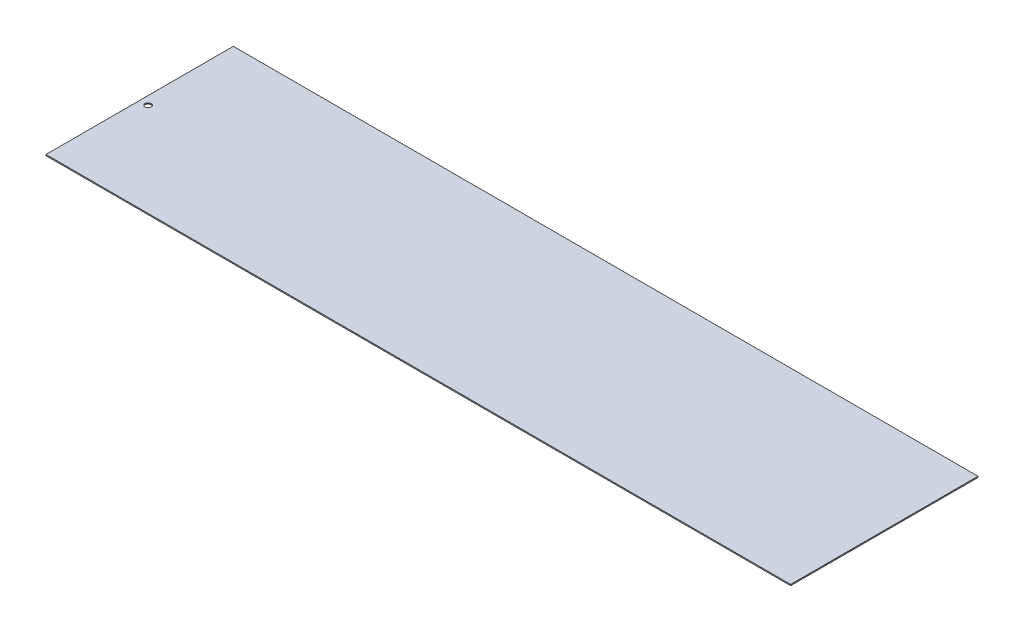
ISO-10303-21;
HEADER;
FILE_DESCRIPTION(('STEP AP214'),'2;1');
FILE_NAME('part.step','',(''),(''),'','','');
FILE_SCHEMA(('AUTOMOTIVE_DESIGN { 1 0 10303 214 1 1 1 1 }'));
ENDSEC;
DATA;
#1=APPLICATION_CONTEXT('core data for automotive mechanical design processes');
#2=APPLICATION_PROTOCOL_DEFINITION('international standard','automotive_design',2000,#1);
#3=PRODUCT_CONTEXT('',#1,'mechanical');
#4=PRODUCT('Part','Part','',(#3));
#5=PRODUCT_RELATED_PRODUCT_CATEGORY('part','',(#4));
#6=PRODUCT_DEFINITION_FORMATION('','',#4);
#7=PRODUCT_DEFINITION_CONTEXT('part definition',#1,'design');
#8=PRODUCT_DEFINITION('design','',#6,#7);
#9=PRODUCT_DEFINITION_SHAPE('','',#8);
#10=(LENGTH_UNIT() NAMED_UNIT(*) SI_UNIT(.MILLI.,.METRE.));
#11=(NAMED_UNIT(*) PLANE_ANGLE_UNIT() SI_UNIT($,.RADIAN.));
#12=(NAMED_UNIT(*) SI_UNIT($,.STERADIAN.) SOLID_ANGLE_UNIT());
#13=UNCERTAINTY_MEASURE_WITH_UNIT(LENGTH_MEASURE(1.E-05),#10,'distance_accuracy_value','');
#14=(GEOMETRIC_REPRESENTATION_CONTEXT(3) GLOBAL_UNCERTAINTY_ASSIGNED_CONTEXT((#13)) GLOBAL_UNIT_ASSIGNED_CONTEXT((#10,
#11,#12)) REPRESENTATION_CONTEXT('',''));
#15=CARTESIAN_POINT('',(0.,0.,0.));
#16=DIRECTION('',(0.,0.,1.));
#17=DIRECTION('',(1.,0.,0.));
#18=AXIS2_PLACEMENT_3D('',#15,#16,#17);
#19=CARTESIAN_POINT('',(238.304446538202,149.129411764706,0.));
#20=DIRECTION('',(0.,0.,-1.));
#21=DIRECTION('',(1.,0.,0.));
#22=AXIS2_PLACEMENT_3D('',#19,#20,#21);
#23=PLANE('',#22);
#24=DIRECTION('',(1.,0.,0.));
#25=VECTOR('',#24,1.);
#26=CARTESIAN_POINT('',(238.304446538202,148.529411764706,0.));
#27=LINE('',#26,#25);
#28=CARTESIAN_POINT('',(-146.503153146805,148.529411764706,0.));
#29=VERTEX_POINT('',#28);
#30=CARTESIAN_POINT('',(648.506116132652,148.529411764706,0.));
#31=VERTEX_POINT('',#30);
#32=EDGE_CURVE('E55',#29,#31,#27,.T.);
#33=ORIENTED_EDGE('',*,*,#32,.F.);
#34=DIRECTION('',(0.,1.,0.));
#35=VECTOR('',#34,1.);
#36=CARTESIAN_POINT('',(-146.503153146805,148.529411764706,0.));
#37=LINE('',#36,#35);
#38=CARTESIAN_POINT('',(-146.503153146805,149.729411764706,0.));
#39=VERTEX_POINT('',#38);
#40=EDGE_CURVE('E102',#29,#39,#37,.T.);
#41=ORIENTED_EDGE('',*,*,#40,.T.);
#42=DIRECTION('',(1.,0.,0.));
#43=VECTOR('',#42,1.);
#44=CARTESIAN_POINT('',(238.304446538202,149.729411764706,0.));
#45=LINE('',#44,#43);
#46=CARTESIAN_POINT('',(648.506116132652,149.729411764706,0.));
#47=VERTEX_POINT('',#46);
#48=EDGE_CURVE('E81',#39,#47,#45,.T.);
#49=ORIENTED_EDGE('',*,*,#48,.T.);
#50=DIRECTION('',(0.,-1.,0.));
#51=VECTOR('',#50,1.);
#52=CARTESIAN_POINT('',(648.506116132652,149.129411764706,0.));
#53=LINE('',#52,#51);
#54=EDGE_CURVE('E116',#47,#31,#53,.T.);
#55=ORIENTED_EDGE('',*,*,#54,.T.);
#56=EDGE_LOOP('',(#33,#41,#49,#55));
#57=FACE_BOUND('',#56,.T.);
#58=ADVANCED_FACE('F44',(#57),#23,.T.);
#59=CARTESIAN_POINT('',(238.304446538202,149.129411764706,200.));
#60=DIRECTION('',(0.,0.,-1.));
#61=DIRECTION('',(1.,0.,0.));
#62=AXIS2_PLACEMENT_3D('',#59,#60,#61);
#63=PLANE('',#62);
#64=DIRECTION('',(1.,0.,0.));
#65=VECTOR('',#64,1.);
#66=CARTESIAN_POINT('',(238.304446538202,149.729411764706,200.));
#67=LINE('',#66,#65);
#68=CARTESIAN_POINT('',(648.506116132652,149.729411764706,200.));
#69=VERTEX_POINT('',#68);
#70=CARTESIAN_POINT('',(-146.503153146805,149.729411764706,200.));
#71=VERTEX_POINT('',#70);
#72=EDGE_CURVE('E48',#69,#71,#67,.F.);
#73=ORIENTED_EDGE('',*,*,#72,.T.);
#74=DIRECTION('',(0.,1.,0.));
#75=VECTOR('',#74,1.);
#76=CARTESIAN_POINT('',(-146.503153146805,148.529411764706,200.));
#77=LINE('',#76,#75);
#78=CARTESIAN_POINT('',(-146.503153146805,148.529411764706,200.));
#79=VERTEX_POINT('',#78);
#80=EDGE_CURVE('E101',#79,#71,#77,.T.);
#81=ORIENTED_EDGE('',*,*,#80,.F.);
#82=DIRECTION('',(1.,0.,0.));
#83=VECTOR('',#82,1.);
#84=CARTESIAN_POINT('',(238.304446538202,148.529411764706,200.));
#85=LINE('',#84,#83);
#86=CARTESIAN_POINT('',(648.506116132652,148.529411764706,200.));
#87=VERTEX_POINT('',#86);
#88=EDGE_CURVE('E12',#87,#79,#85,.F.);
#89=ORIENTED_EDGE('',*,*,#88,.F.);
#90=DIRECTION('',(0.,-1.,0.));
#91=VECTOR('',#90,1.);
#92=CARTESIAN_POINT('',(648.506116132652,149.129411764706,200.));
#93=LINE('',#92,#91);
#94=EDGE_CURVE('E119',#69,#87,#93,.T.);
#95=ORIENTED_EDGE('',*,*,#94,.F.);
#96=EDGE_LOOP('',(#73,#81,#89,#95));
#97=FACE_BOUND('',#96,.T.);
#98=ADVANCED_FACE('F106',(#97),#63,.F.);
#99=CARTESIAN_POINT('',(-20.9526571305515,148.529411764706,200.));
#100=DIRECTION('',(0.,-1.,0.));
#101=DIRECTION('',(0.,0.,-1.));
#102=AXIS2_PLACEMENT_3D('',#99,#100,#101);
#103=PLANE('',#102);
#104=ORIENTED_EDGE('',*,*,#32,.T.);
#105=DIRECTION('',(0.,0.,1.));
#106=VECTOR('',#105,1.);
#107=CARTESIAN_POINT('',(648.506116132652,148.529411764706,100.));
#108=LINE('',#107,#106);
#109=EDGE_CURVE('E97',#31,#87,#108,.T.);
#110=ORIENTED_EDGE('',*,*,#109,.T.);
#111=ORIENTED_EDGE('',*,*,#88,.T.);
#112=DIRECTION('',(0.,0.,-1.));
#113=VECTOR('',#112,1.);
#114=CARTESIAN_POINT('',(-146.503153146805,148.529411764706,200.));
#115=LINE('',#114,#113);
#116=EDGE_CURVE('E94',#79,#29,#115,.T.);
#117=ORIENTED_EDGE('',*,*,#116,.T.);
#118=EDGE_LOOP('',(#104,#110,#111,#117));
#119=FACE_BOUND('',#118,.T.);
#120=CARTESIAN_POINT('',(-137.503153146804,148.529411764706,100.));
#121=DIRECTION('',(0.,-1.,0.));
#122=DIRECTION('',(0.,0.,-1.));
#123=AXIS2_PLACEMENT_3D('',#120,#121,#122);
#124=CIRCLE('',#123,3.25000000000001);
#125=CARTESIAN_POINT('',(-137.503153146804,148.529411764706,96.75));
#126=VERTEX_POINT('',#125);
#127=EDGE_CURVE('E104',#126,#126,#124,.F.);
#128=ORIENTED_EDGE('',*,*,#127,.T.);
#129=EDGE_LOOP('',(#128));
#130=FACE_BOUND('',#129,.T.);
#131=ADVANCED_FACE('F46',(#119,#130),#103,.T.);
#132=CARTESIAN_POINT('',(238.304446538202,149.729411764706,100.));
#133=DIRECTION('',(0.,-1.,0.));
#134=DIRECTION('',(1.,0.,0.));
#135=AXIS2_PLACEMENT_3D('',#132,#133,#134);
#136=PLANE('',#135);
#137=ORIENTED_EDGE('',*,*,#72,.F.);
#138=DIRECTION('',(0.,0.,1.));
#139=VECTOR('',#138,1.);
#140=CARTESIAN_POINT('',(648.506116132652,149.729411764706,100.));
#141=LINE('',#140,#139);
#142=EDGE_CURVE('E121',#47,#69,#141,.T.);
#143=ORIENTED_EDGE('',*,*,#142,.F.);
#144=ORIENTED_EDGE('',*,*,#48,.F.);
#145=DIRECTION('',(0.,0.,-1.));
#146=VECTOR('',#145,1.);
#147=CARTESIAN_POINT('',(-146.503153146805,149.729411764706,200.));
#148=LINE('',#147,#146);
#149=EDGE_CURVE('E108',#71,#39,#148,.T.);
#150=ORIENTED_EDGE('',*,*,#149,.F.);
#151=EDGE_LOOP('',(#137,#143,#144,#150));
#152=FACE_BOUND('',#151,.T.);
#153=CARTESIAN_POINT('',(-137.503153146804,149.729411764706,100.));
#154=DIRECTION('',(0.,1.,0.));
#155=DIRECTION('',(0.,0.,1.));
#156=AXIS2_PLACEMENT_3D('',#153,#154,#155);
#157=CIRCLE('',#156,3.25000000000001);
#158=CARTESIAN_POINT('',(-137.503153146804,149.729411764706,103.25));
#159=VERTEX_POINT('',#158);
#160=EDGE_CURVE('E112',#159,#159,#157,.T.);
#161=ORIENTED_EDGE('',*,*,#160,.F.);
#162=EDGE_LOOP('',(#161));
#163=FACE_BOUND('',#162,.T.);
#164=ADVANCED_FACE('F137',(#152,#163),#136,.F.);
#165=CARTESIAN_POINT('',(648.506116132652,149.129411764706,100.));
#166=DIRECTION('',(1.,0.,0.));
#167=DIRECTION('',(0.,0.,1.));
#168=AXIS2_PLACEMENT_3D('',#165,#166,#167);
#169=PLANE('',#168);
#170=ORIENTED_EDGE('',*,*,#54,.F.);
#171=ORIENTED_EDGE('',*,*,#142,.T.);
#172=ORIENTED_EDGE('',*,*,#94,.T.);
#173=ORIENTED_EDGE('',*,*,#109,.F.);
#174=EDGE_LOOP('',(#170,#171,#172,#173));
#175=FACE_BOUND('',#174,.T.);
#176=ADVANCED_FACE('F136',(#175),#169,.T.);
#177=CARTESIAN_POINT('',(-146.503153146805,148.529411764706,200.));
#178=DIRECTION('',(-1.,0.,0.));
#179=DIRECTION('',(0.,0.,1.));
#180=AXIS2_PLACEMENT_3D('',#177,#178,#179);
#181=PLANE('',#180);
#182=ORIENTED_EDGE('',*,*,#40,.F.);
#183=ORIENTED_EDGE('',*,*,#116,.F.);
#184=ORIENTED_EDGE('',*,*,#80,.T.);
#185=ORIENTED_EDGE('',*,*,#149,.T.);
#186=EDGE_LOOP('',(#182,#183,#184,#185));
#187=FACE_BOUND('',#186,.T.);
#188=ADVANCED_FACE('F100',(#187),#181,.T.);
#189=CARTESIAN_POINT('',(-137.503153146804,-101.201,100.));
#190=DIRECTION('',(0.,1.,0.));
#191=DIRECTION('',(0.,0.,1.));
#192=AXIS2_PLACEMENT_3D('',#189,#190,#191);
#193=CYLINDRICAL_SURFACE('',#192,3.25000000000001);
#194=ORIENTED_EDGE('',*,*,#127,.F.);
#195=EDGE_LOOP('',(#194));
#196=FACE_BOUND('',#195,.T.);
#197=ORIENTED_EDGE('',*,*,#160,.T.);
#198=EDGE_LOOP('',(#197));
#199=FACE_BOUND('',#198,.T.);
#200=ADVANCED_FACE('F155',(#196,#199),#193,.F.);
#201=CLOSED_SHELL('',(#58,#98,#131,#164,#176,#188,#200));
#202=MANIFOLD_SOLID_BREP('B2',#201);
#203=ADVANCED_BREP_SHAPE_REPRESENTATION('',(#18,#202),#14);
#204=SHAPE_DEFINITION_REPRESENTATION(#9,#203);
ENDSEC;
END-ISO-10303-21;
